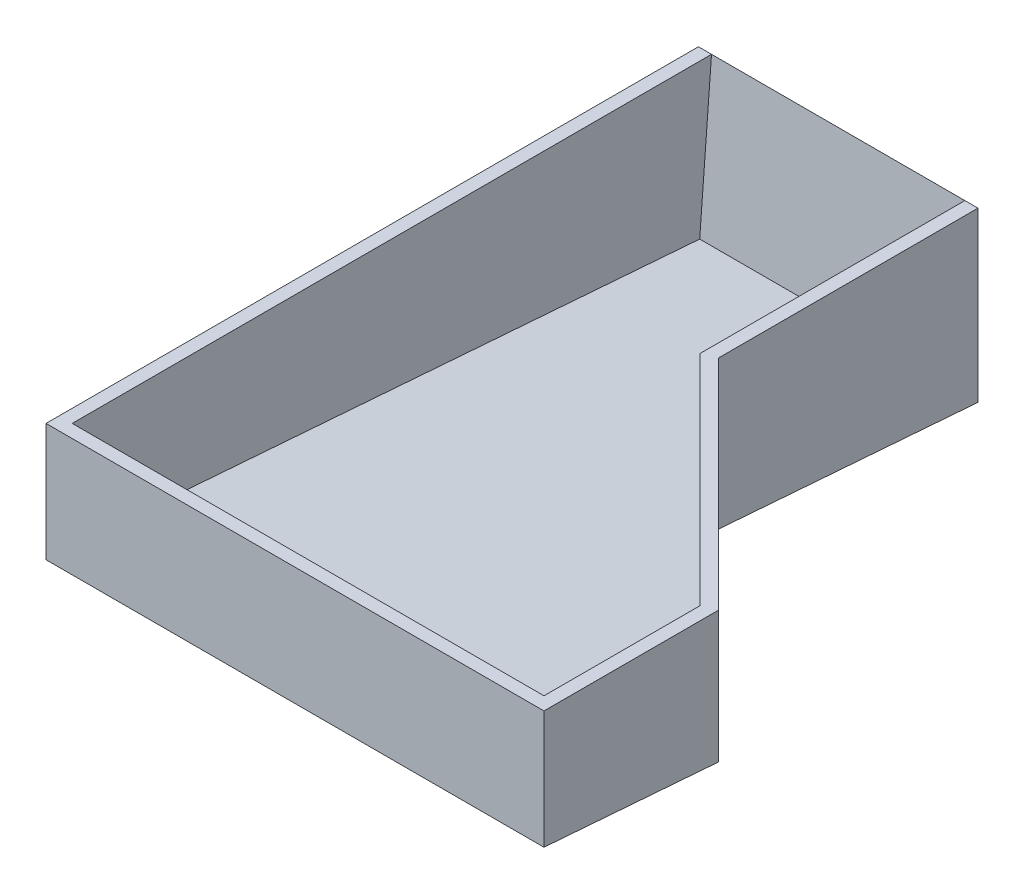
ISO-10303-21;
HEADER;
FILE_DESCRIPTION(('STEP AP214'),'2;1');
FILE_NAME('part.step','',(''),(''),'','','');
FILE_SCHEMA(('AUTOMOTIVE_DESIGN { 1 0 10303 214 1 1 1 1 }'));
ENDSEC;
DATA;
#1=APPLICATION_CONTEXT('core data for automotive mechanical design processes');
#2=APPLICATION_PROTOCOL_DEFINITION('international standard','automotive_design',2000,#1);
#3=PRODUCT_CONTEXT('',#1,'mechanical');
#4=PRODUCT('Part','Part','',(#3));
#5=PRODUCT_RELATED_PRODUCT_CATEGORY('part','',(#4));
#6=PRODUCT_DEFINITION_FORMATION('','',#4);
#7=PRODUCT_DEFINITION_CONTEXT('part definition',#1,'design');
#8=PRODUCT_DEFINITION('design','',#6,#7);
#9=PRODUCT_DEFINITION_SHAPE('','',#8);
#10=(LENGTH_UNIT() NAMED_UNIT(*) SI_UNIT(.MILLI.,.METRE.));
#11=(NAMED_UNIT(*) PLANE_ANGLE_UNIT() SI_UNIT($,.RADIAN.));
#12=(NAMED_UNIT(*) SI_UNIT($,.STERADIAN.) SOLID_ANGLE_UNIT());
#13=UNCERTAINTY_MEASURE_WITH_UNIT(LENGTH_MEASURE(1.E-05),#10,'distance_accuracy_value','');
#14=(GEOMETRIC_REPRESENTATION_CONTEXT(3) GLOBAL_UNCERTAINTY_ASSIGNED_CONTEXT((#13)) GLOBAL_UNIT_ASSIGNED_CONTEXT((#10,
#11,#12)) REPRESENTATION_CONTEXT('',''));
#15=CARTESIAN_POINT('',(0.,0.,0.));
#16=DIRECTION('',(0.,0.,1.));
#17=DIRECTION('',(1.,0.,0.));
#18=AXIS2_PLACEMENT_3D('',#15,#16,#17);
#19=CARTESIAN_POINT('',(61.,0.,0.));
#20=DIRECTION('',(-1.,0.,0.));
#21=DIRECTION('',(0.,0.,1.));
#22=AXIS2_PLACEMENT_3D('',#19,#20,#21);
#23=PLANE('',#22);
#24=DIRECTION('',(0.,-0.0765634334109547,-0.997064712375444));
#25=VECTOR('',#24,1.);
#26=CARTESIAN_POINT('',(61.,2.99119413712634,-0.229690300232864));
#27=LINE('',#26,#25);
#28=CARTESIAN_POINT('',(61.,7.6620287859887,60.5973154679655));
#29=VERTEX_POINT('',#28);
#30=CARTESIAN_POINT('',(61.,3.21687957154979,2.70934956169365));
#31=VERTEX_POINT('',#30);
#32=EDGE_CURVE('E140',#29,#31,#27,.T.);
#33=ORIENTED_EDGE('',*,*,#32,.F.);
#34=DIRECTION('',(0.,1.,0.));
#35=VECTOR('',#34,1.);
#36=CARTESIAN_POINT('',(61.,-95.0945759694716,60.5973154679655));
#37=LINE('',#36,#35);
#38=CARTESIAN_POINT('',(61.,38.5,60.5973154679655));
#39=VERTEX_POINT('',#38);
#40=EDGE_CURVE('E126',#29,#39,#37,.T.);
#41=ORIENTED_EDGE('',*,*,#40,.T.);
#42=DIRECTION('',(0.,0.,1.));
#43=VECTOR('',#42,1.);
#44=CARTESIAN_POINT('',(61.,38.5,0.));
#45=LINE('',#44,#43);
#46=CARTESIAN_POINT('',(61.,38.5,0.));
#47=VERTEX_POINT('',#46);
#48=EDGE_CURVE('E222',#47,#39,#45,.T.);
#49=ORIENTED_EDGE('',*,*,#48,.F.);
#50=DIRECTION('',(0.,0.997064712375443,-0.0765634334109623));
#51=VECTOR('',#50,1.);
#52=CARTESIAN_POINT('',(61.,0.225685434423482,2.93903986192653));
#53=LINE('',#52,#51);
#54=EDGE_CURVE('E147',#31,#47,#53,.T.);
#55=ORIENTED_EDGE('',*,*,#54,.F.);
#56=EDGE_LOOP('',(#33,#41,#49,#55));
#57=FACE_BOUND('',#56,.T.);
#58=ADVANCED_FACE('F39',(#57),#23,.T.);
#59=CARTESIAN_POINT('',(64.,0.,0.));
#60=DIRECTION('',(-1.,0.,0.));
#61=DIRECTION('',(0.,0.,1.));
#62=AXIS2_PLACEMENT_3D('',#59,#60,#61);
#63=PLANE('',#62);
#64=DIRECTION('',(0.,1.,0.));
#65=VECTOR('',#64,1.);
#66=CARTESIAN_POINT('',(64.,-95.0945759694716,59.3546747808462));
#67=LINE('',#66,#65);
#68=CARTESIAN_POINT('',(64.,4.55777607391747,59.3546747808462));
#69=VERTEX_POINT('',#68);
#70=CARTESIAN_POINT('',(64.,38.5,59.3546747808463));
#71=VERTEX_POINT('',#70);
#72=EDGE_CURVE('E62',#69,#71,#67,.T.);
#73=ORIENTED_EDGE('',*,*,#72,.F.);
#74=DIRECTION('',(0.,0.0765634334109548,0.997064712375444));
#75=VECTOR('',#74,1.);
#76=CARTESIAN_POINT('',(64.,0.,0.));
#77=LINE('',#76,#75);
#78=CARTESIAN_POINT('',(64.,0.,0.));
#79=VERTEX_POINT('',#78);
#80=EDGE_CURVE('E223',#79,#69,#77,.T.);
#81=ORIENTED_EDGE('',*,*,#80,.F.);
#82=DIRECTION('',(0.,1.,0.));
#83=VECTOR('',#82,1.);
#84=CARTESIAN_POINT('',(64.,0.,0.));
#85=LINE('',#84,#83);
#86=CARTESIAN_POINT('',(64.,38.5,0.));
#87=VERTEX_POINT('',#86);
#88=EDGE_CURVE('E225',#79,#87,#85,.T.);
#89=ORIENTED_EDGE('',*,*,#88,.T.);
#90=DIRECTION('',(0.,0.,1.));
#91=VECTOR('',#90,1.);
#92=CARTESIAN_POINT('',(64.,38.5,0.));
#93=LINE('',#92,#91);
#94=EDGE_CURVE('E227',#87,#71,#93,.T.);
#95=ORIENTED_EDGE('',*,*,#94,.T.);
#96=EDGE_LOOP('',(#73,#81,#89,#95));
#97=FACE_BOUND('',#96,.T.);
#98=ADVANCED_FACE('F262',(#97),#63,.F.);
#99=CARTESIAN_POINT('',(3.,0.,0.));
#100=DIRECTION('',(1.,0.,0.));
#101=DIRECTION('',(0.,0.,-1.));
#102=AXIS2_PLACEMENT_3D('',#99,#100,#101);
#103=PLANE('',#102);
#104=DIRECTION('',(0.,0.,1.));
#105=VECTOR('',#104,1.);
#106=CARTESIAN_POINT('',(3.,38.5,0.));
#107=LINE('',#106,#105);
#108=CARTESIAN_POINT('',(3.,38.5,0.));
#109=VERTEX_POINT('',#108);
#110=CARTESIAN_POINT('',(3.,38.5,146.354674780847));
#111=VERTEX_POINT('',#110);
#112=EDGE_CURVE('E173',#109,#111,#107,.T.);
#113=ORIENTED_EDGE('',*,*,#112,.T.);
#114=DIRECTION('',(0.,-1.,0.));
#115=VECTOR('',#114,1.);
#116=CARTESIAN_POINT('',(3.,0.,146.354674780847));
#117=LINE('',#116,#115);
#118=CARTESIAN_POINT('',(3.,14.2472361328703,146.354674780847));
#119=VERTEX_POINT('',#118);
#120=EDGE_CURVE('E160',#111,#119,#117,.T.);
#121=ORIENTED_EDGE('',*,*,#120,.T.);
#122=DIRECTION('',(0.,-0.0765634334109547,-0.997064712375444));
#123=VECTOR('',#122,1.);
#124=CARTESIAN_POINT('',(3.,2.99119413712634,-0.229690300232864));
#125=LINE('',#124,#123);
#126=CARTESIAN_POINT('',(3.,3.21687957154979,2.70934956169365));
#127=VERTEX_POINT('',#126);
#128=EDGE_CURVE('E154',#119,#127,#125,.T.);
#129=ORIENTED_EDGE('',*,*,#128,.T.);
#130=DIRECTION('',(0.,0.997064712375443,-0.0765634334109623));
#131=VECTOR('',#130,1.);
#132=CARTESIAN_POINT('',(3.,0.225685434423482,2.93903986192653));
#133=LINE('',#132,#131);
#134=EDGE_CURVE('E149',#127,#109,#133,.T.);
#135=ORIENTED_EDGE('',*,*,#134,.T.);
#136=EDGE_LOOP('',(#113,#121,#129,#135));
#137=FACE_BOUND('',#136,.T.);
#138=ADVANCED_FACE('F240',(#137),#103,.T.);
#139=CARTESIAN_POINT('',(3.,0.,0.));
#140=DIRECTION('',(0.,0.,1.));
#141=DIRECTION('',(1.,0.,0.));
#142=AXIS2_PLACEMENT_3D('',#139,#140,#141);
#143=PLANE('',#142);
#144=DIRECTION('',(0.,1.,0.));
#145=VECTOR('',#144,1.);
#146=CARTESIAN_POINT('',(0.,0.,0.));
#147=LINE('',#146,#145);
#148=CARTESIAN_POINT('',(0.,0.,0.));
#149=VERTEX_POINT('',#148);
#150=CARTESIAN_POINT('',(0.,38.5,0.));
#151=VERTEX_POINT('',#150);
#152=EDGE_CURVE('E167',#149,#151,#147,.T.);
#153=ORIENTED_EDGE('',*,*,#152,.T.);
#154=DIRECTION('',(-1.,0.,0.));
#155=VECTOR('',#154,1.);
#156=CARTESIAN_POINT('',(3.,38.5,0.));
#157=LINE('',#156,#155);
#158=EDGE_CURVE('E11',#109,#151,#157,.T.);
#159=ORIENTED_EDGE('',*,*,#158,.F.);
#160=DIRECTION('',(-1.,0.,0.));
#161=VECTOR('',#160,1.);
#162=CARTESIAN_POINT('',(61.,38.5,0.));
#163=LINE('',#162,#161);
#164=EDGE_CURVE('E165',#47,#109,#163,.T.);
#165=ORIENTED_EDGE('',*,*,#164,.F.);
#166=DIRECTION('',(-1.,0.,0.));
#167=VECTOR('',#166,1.);
#168=CARTESIAN_POINT('',(64.,38.5,0.));
#169=LINE('',#168,#167);
#170=EDGE_CURVE('E157',#87,#47,#169,.T.);
#171=ORIENTED_EDGE('',*,*,#170,.F.);
#172=ORIENTED_EDGE('',*,*,#88,.F.);
#173=DIRECTION('',(-1.,0.,0.));
#174=VECTOR('',#173,1.);
#175=CARTESIAN_POINT('',(3.,0.,0.));
#176=LINE('',#175,#174);
#177=EDGE_CURVE('E176',#79,#149,#176,.T.);
#178=ORIENTED_EDGE('',*,*,#177,.T.);
#179=EDGE_LOOP('',(#153,#159,#165,#171,#172,#178));
#180=FACE_BOUND('',#179,.T.);
#181=ADVANCED_FACE('F41',(#180),#143,.F.);
#182=CARTESIAN_POINT('',(3.,38.5,0.));
#183=DIRECTION('',(0.,-1.,0.));
#184=DIRECTION('',(0.,0.,-1.));
#185=AXIS2_PLACEMENT_3D('',#182,#183,#184);
#186=PLANE('',#185);
#187=DIRECTION('',(0.,0.,-1.));
#188=VECTOR('',#187,1.);
#189=CARTESIAN_POINT('',(111.,38.5,0.));
#190=LINE('',#189,#188);
#191=CARTESIAN_POINT('',(111.,38.5,146.354674780847));
#192=VERTEX_POINT('',#191);
#193=CARTESIAN_POINT('',(111.,38.5,110.597315467966));
#194=VERTEX_POINT('',#193);
#195=EDGE_CURVE('E253',#192,#194,#190,.T.);
#196=ORIENTED_EDGE('',*,*,#195,.F.);
#197=DIRECTION('',(-1.,0.,0.));
#198=VECTOR('',#197,1.);
#199=CARTESIAN_POINT('',(61.,38.5,146.354674780847));
#200=LINE('',#199,#198);
#201=EDGE_CURVE('E151',#192,#111,#200,.T.);
#202=ORIENTED_EDGE('',*,*,#201,.T.);
#203=ORIENTED_EDGE('',*,*,#112,.F.);
#204=ORIENTED_EDGE('',*,*,#158,.T.);
#205=DIRECTION('',(0.,0.,1.));
#206=VECTOR('',#205,1.);
#207=CARTESIAN_POINT('',(0.,38.5,0.));
#208=LINE('',#207,#206);
#209=CARTESIAN_POINT('',(0.,38.5,149.354674780847));
#210=VERTEX_POINT('',#209);
#211=EDGE_CURVE('E180',#151,#210,#208,.T.);
#212=ORIENTED_EDGE('',*,*,#211,.T.);
#213=DIRECTION('',(-1.,0.,0.));
#214=VECTOR('',#213,1.);
#215=CARTESIAN_POINT('',(3.,38.5,149.354674780847));
#216=LINE('',#215,#214);
#217=CARTESIAN_POINT('',(114.,38.5,149.354674780847));
#218=VERTEX_POINT('',#217);
#219=EDGE_CURVE('E47',#218,#210,#216,.T.);
#220=ORIENTED_EDGE('',*,*,#219,.F.);
#221=DIRECTION('',(0.,0.,-1.));
#222=VECTOR('',#221,1.);
#223=CARTESIAN_POINT('',(114.,38.5,0.));
#224=LINE('',#223,#222);
#225=CARTESIAN_POINT('',(114.,38.5,109.354674780847));
#226=VERTEX_POINT('',#225);
#227=EDGE_CURVE('E216',#218,#226,#224,.T.);
#228=ORIENTED_EDGE('',*,*,#227,.T.);
#229=DIRECTION('',(-0.707106781186544,0.,-0.707106781186551));
#230=VECTOR('',#229,1.);
#231=CARTESIAN_POINT('',(2.3226626095772,38.5,-2.32266260957717));
#232=LINE('',#231,#230);
#233=EDGE_CURVE('E256',#226,#71,#232,.T.);
#234=ORIENTED_EDGE('',*,*,#233,.T.);
#235=ORIENTED_EDGE('',*,*,#94,.F.);
#236=ORIENTED_EDGE('',*,*,#170,.T.);
#237=ORIENTED_EDGE('',*,*,#48,.T.);
#238=DIRECTION('',(-0.707106781186544,0.,-0.707106781186551));
#239=VECTOR('',#238,1.);
#240=CARTESIAN_POINT('',(0.20134226601755,38.5,-0.201342266017541));
#241=LINE('',#240,#239);
#242=EDGE_CURVE('E54',#194,#39,#241,.T.);
#243=ORIENTED_EDGE('',*,*,#242,.F.);
#244=EDGE_LOOP('',(#196,#202,#203,#204,#212,#220,#228,#234,#235,#236,#237,#243));
#245=FACE_BOUND('',#244,.T.);
#246=ADVANCED_FACE('F229',(#245),#186,.F.);
#247=CARTESIAN_POINT('',(3.,1.53356880097127E-13,149.354674780847));
#248=DIRECTION('',(0.,0.,-1.));
#249=DIRECTION('',(0.,1.,0.));
#250=AXIS2_PLACEMENT_3D('',#247,#248,#249);
#251=PLANE('',#250);
#252=DIRECTION('',(0.,-1.,0.));
#253=VECTOR('',#252,1.);
#254=CARTESIAN_POINT('',(0.,1.53356880097127E-13,149.354674780847));
#255=LINE('',#254,#253);
#256=CARTESIAN_POINT('',(0.,11.4687708383087,149.354674780847));
#257=VERTEX_POINT('',#256);
#258=EDGE_CURVE('E182',#210,#257,#255,.T.);
#259=ORIENTED_EDGE('',*,*,#258,.T.);
#260=DIRECTION('',(-1.,0.,0.));
#261=VECTOR('',#260,1.);
#262=CARTESIAN_POINT('',(3.,11.4687708383087,149.354674780847));
#263=LINE('',#262,#261);
#264=CARTESIAN_POINT('',(114.,11.4687708383087,149.354674780847));
#265=VERTEX_POINT('',#264);
#266=EDGE_CURVE('E188',#265,#257,#263,.T.);
#267=ORIENTED_EDGE('',*,*,#266,.F.);
#268=DIRECTION('',(0.,1.,0.));
#269=VECTOR('',#268,1.);
#270=CARTESIAN_POINT('',(114.,-95.0945759694716,149.354674780847));
#271=LINE('',#270,#269);
#272=EDGE_CURVE('E195',#265,#218,#271,.T.);
#273=ORIENTED_EDGE('',*,*,#272,.T.);
#274=ORIENTED_EDGE('',*,*,#219,.T.);
#275=EDGE_LOOP('',(#259,#267,#273,#274));
#276=FACE_BOUND('',#275,.T.);
#277=ADVANCED_FACE('F193',(#276),#251,.F.);
#278=CARTESIAN_POINT('',(3.,0.,0.));
#279=DIRECTION('',(0.,-0.997064712375444,0.0765634334109548));
#280=DIRECTION('',(0.,-0.0765634334109548,-0.997064712375444));
#281=AXIS2_PLACEMENT_3D('',#278,#279,#280);
#282=PLANE('',#281);
#283=DIRECTION('',(0.,0.0765634334109548,0.997064712375444));
#284=VECTOR('',#283,1.);
#285=CARTESIAN_POINT('',(0.,0.,0.));
#286=LINE('',#285,#284);
#287=EDGE_CURVE('E177',#149,#257,#286,.T.);
#288=ORIENTED_EDGE('',*,*,#287,.F.);
#289=ORIENTED_EDGE('',*,*,#177,.F.);
#290=ORIENTED_EDGE('',*,*,#80,.T.);
#291=DIRECTION('',(-0.706066712300377,-0.0542180372446542,-0.706066712300384));
#292=VECTOR('',#291,1.);
#293=CARTESIAN_POINT('',(-1.31087759049733,-0.457369849257275,-5.95620280965175));
#294=LINE('',#293,#292);
#295=CARTESIAN_POINT('',(114.,8.39721760969041,109.354674780847));
#296=VERTEX_POINT('',#295);
#297=EDGE_CURVE('E210',#296,#69,#294,.T.);
#298=ORIENTED_EDGE('',*,*,#297,.F.);
#299=DIRECTION('',(0.,-0.0765634334109548,-0.997064712375444));
#300=VECTOR('',#299,1.);
#301=CARTESIAN_POINT('',(114.,-0.557440537376178,-7.25939608901952));
#302=LINE('',#301,#300);
#303=EDGE_CURVE('E208',#265,#296,#302,.T.);
#304=ORIENTED_EDGE('',*,*,#303,.F.);
#305=ORIENTED_EDGE('',*,*,#266,.T.);
#306=EDGE_LOOP('',(#288,#289,#290,#298,#304,#305));
#307=FACE_BOUND('',#306,.T.);
#308=ADVANCED_FACE('F204',(#307),#282,.T.);
#309=CARTESIAN_POINT('',(0.,0.,0.));
#310=DIRECTION('',(1.,0.,0.));
#311=DIRECTION('',(0.,0.,-1.));
#312=AXIS2_PLACEMENT_3D('',#309,#310,#311);
#313=PLANE('',#312);
#314=ORIENTED_EDGE('',*,*,#152,.F.);
#315=ORIENTED_EDGE('',*,*,#287,.T.);
#316=ORIENTED_EDGE('',*,*,#258,.F.);
#317=ORIENTED_EDGE('',*,*,#211,.F.);
#318=EDGE_LOOP('',(#314,#315,#316,#317));
#319=FACE_BOUND('',#318,.T.);
#320=ADVANCED_FACE('F201',(#319),#313,.F.);
#321=CARTESIAN_POINT('',(61.,0.225685434423482,2.93903986192653));
#322=DIRECTION('',(0.,0.0765634334109623,0.997064712375443));
#323=DIRECTION('',(0.,-0.997064712375443,0.0765634334109623));
#324=AXIS2_PLACEMENT_3D('',#321,#322,#323);
#325=PLANE('',#324);
#326=ORIENTED_EDGE('',*,*,#134,.F.);
#327=DIRECTION('',(-1.,0.,0.));
#328=VECTOR('',#327,1.);
#329=CARTESIAN_POINT('',(61.,3.21687957154979,2.70934956169365));
#330=LINE('',#329,#328);
#331=EDGE_CURVE('E168',#31,#127,#330,.T.);
#332=ORIENTED_EDGE('',*,*,#331,.F.);
#333=ORIENTED_EDGE('',*,*,#54,.T.);
#334=ORIENTED_EDGE('',*,*,#164,.T.);
#335=EDGE_LOOP('',(#326,#332,#333,#334));
#336=FACE_BOUND('',#335,.T.);
#337=ADVANCED_FACE('F237',(#336),#325,.T.);
#338=CARTESIAN_POINT('',(61.,2.99119413712634,-0.229690300232864));
#339=DIRECTION('',(0.,0.997064712375444,-0.0765634334109547));
#340=DIRECTION('',(0.,0.0765634334109547,0.997064712375444));
#341=AXIS2_PLACEMENT_3D('',#338,#339,#340);
#342=PLANE('',#341);
#343=ORIENTED_EDGE('',*,*,#128,.F.);
#344=DIRECTION('',(-1.,0.,0.));
#345=VECTOR('',#344,1.);
#346=CARTESIAN_POINT('',(61.,14.2472361328703,146.354674780847));
#347=LINE('',#346,#345);
#348=CARTESIAN_POINT('',(111.,14.2472361328702,146.354674780847));
#349=VERTEX_POINT('',#348);
#350=EDGE_CURVE('E170',#349,#119,#347,.T.);
#351=ORIENTED_EDGE('',*,*,#350,.F.);
#352=DIRECTION('',(0.,-0.0765634334109548,-0.997064712375444));
#353=VECTOR('',#352,1.);
#354=CARTESIAN_POINT('',(111.,2.43375359975015,-7.48908638925238));
#355=LINE('',#354,#353);
#356=CARTESIAN_POINT('',(111.,11.5014703217616,110.597315467966));
#357=VERTEX_POINT('',#356);
#358=EDGE_CURVE('E143',#349,#357,#355,.T.);
#359=ORIENTED_EDGE('',*,*,#358,.T.);
#360=DIRECTION('',(-0.706066712300377,-0.0542180372446542,-0.706066712300384));
#361=VECTOR('',#360,1.);
#362=CARTESIAN_POINT('',(-3.553616506336,2.70503205601302,-3.95630103837114));
#363=LINE('',#362,#361);
#364=EDGE_CURVE('E129',#357,#29,#363,.T.);
#365=ORIENTED_EDGE('',*,*,#364,.T.);
#366=ORIENTED_EDGE('',*,*,#32,.T.);
#367=ORIENTED_EDGE('',*,*,#331,.T.);
#368=EDGE_LOOP('',(#343,#351,#359,#365,#366,#367));
#369=FACE_BOUND('',#368,.T.);
#370=ADVANCED_FACE('F139',(#369),#342,.T.);
#371=CARTESIAN_POINT('',(61.,0.,146.354674780847));
#372=DIRECTION('',(0.,0.,-1.));
#373=DIRECTION('',(-1.,0.,0.));
#374=AXIS2_PLACEMENT_3D('',#371,#372,#373);
#375=PLANE('',#374);
#376=ORIENTED_EDGE('',*,*,#120,.F.);
#377=ORIENTED_EDGE('',*,*,#201,.F.);
#378=DIRECTION('',(0.,1.,0.));
#379=VECTOR('',#378,1.);
#380=CARTESIAN_POINT('',(111.,-95.0945759694714,146.354674780847));
#381=LINE('',#380,#379);
#382=EDGE_CURVE('E135',#349,#192,#381,.T.);
#383=ORIENTED_EDGE('',*,*,#382,.F.);
#384=ORIENTED_EDGE('',*,*,#350,.T.);
#385=EDGE_LOOP('',(#376,#377,#383,#384));
#386=FACE_BOUND('',#385,.T.);
#387=ADVANCED_FACE('F243',(#386),#375,.T.);
#388=CARTESIAN_POINT('',(2.3226626095772,-95.0945759694716,-2.3226626095772));
#389=DIRECTION('',(0.707106781186551,0.,-0.707106781186544));
#390=DIRECTION('',(-0.707106781186544,0.,-0.707106781186551));
#391=AXIS2_PLACEMENT_3D('',#388,#389,#390);
#392=PLANE('',#391);
#393=DIRECTION('',(0.,1.,0.));
#394=VECTOR('',#393,1.);
#395=CARTESIAN_POINT('',(114.,-95.0945759694716,109.354674780847));
#396=LINE('',#395,#394);
#397=EDGE_CURVE('E213',#296,#226,#396,.T.);
#398=ORIENTED_EDGE('',*,*,#397,.F.);
#399=ORIENTED_EDGE('',*,*,#297,.T.);
#400=ORIENTED_EDGE('',*,*,#72,.T.);
#401=ORIENTED_EDGE('',*,*,#233,.F.);
#402=EDGE_LOOP('',(#398,#399,#400,#401));
#403=FACE_BOUND('',#402,.T.);
#404=ADVANCED_FACE('F260',(#403),#392,.T.);
#405=CARTESIAN_POINT('',(114.,-95.0945759694716,0.));
#406=DIRECTION('',(1.,0.,0.));
#407=DIRECTION('',(0.,0.,-1.));
#408=AXIS2_PLACEMENT_3D('',#405,#406,#407);
#409=PLANE('',#408);
#410=ORIENTED_EDGE('',*,*,#272,.F.);
#411=ORIENTED_EDGE('',*,*,#303,.T.);
#412=ORIENTED_EDGE('',*,*,#397,.T.);
#413=ORIENTED_EDGE('',*,*,#227,.F.);
#414=EDGE_LOOP('',(#410,#411,#412,#413));
#415=FACE_BOUND('',#414,.T.);
#416=ADVANCED_FACE('F215',(#415),#409,.T.);
#417=CARTESIAN_POINT('',(0.20134226601755,-95.0945759694716,-0.201342266017566));
#418=DIRECTION('',(0.707106781186551,0.,-0.707106781186544));
#419=DIRECTION('',(-0.707106781186544,0.,-0.707106781186551));
#420=AXIS2_PLACEMENT_3D('',#417,#418,#419);
#421=PLANE('',#420);
#422=DIRECTION('',(0.,1.,0.));
#423=VECTOR('',#422,1.);
#424=CARTESIAN_POINT('',(111.,-95.0945759694716,110.597315467966));
#425=LINE('',#424,#423);
#426=EDGE_CURVE('E249',#357,#194,#425,.T.);
#427=ORIENTED_EDGE('',*,*,#426,.T.);
#428=ORIENTED_EDGE('',*,*,#242,.T.);
#429=ORIENTED_EDGE('',*,*,#40,.F.);
#430=ORIENTED_EDGE('',*,*,#364,.F.);
#431=EDGE_LOOP('',(#427,#428,#429,#430));
#432=FACE_BOUND('',#431,.T.);
#433=ADVANCED_FACE('F128',(#432),#421,.F.);
#434=CARTESIAN_POINT('',(111.,-95.0945759694716,0.));
#435=DIRECTION('',(1.,0.,0.));
#436=DIRECTION('',(0.,0.,-1.));
#437=AXIS2_PLACEMENT_3D('',#434,#435,#436);
#438=PLANE('',#437);
#439=ORIENTED_EDGE('',*,*,#382,.T.);
#440=ORIENTED_EDGE('',*,*,#195,.T.);
#441=ORIENTED_EDGE('',*,*,#426,.F.);
#442=ORIENTED_EDGE('',*,*,#358,.F.);
#443=EDGE_LOOP('',(#439,#440,#441,#442));
#444=FACE_BOUND('',#443,.T.);
#445=ADVANCED_FACE('F338',(#444),#438,.F.);
#446=CLOSED_SHELL('',(#58,#98,#138,#181,#246,#277,#308,#320,#337,#370,#387,#404,#416,#433,#445));
#447=MANIFOLD_SOLID_BREP('B2',#446);
#448=ADVANCED_BREP_SHAPE_REPRESENTATION('',(#18,#447),#14);
#449=SHAPE_DEFINITION_REPRESENTATION(#9,#448);
ENDSEC;
END-ISO-10303-21;
